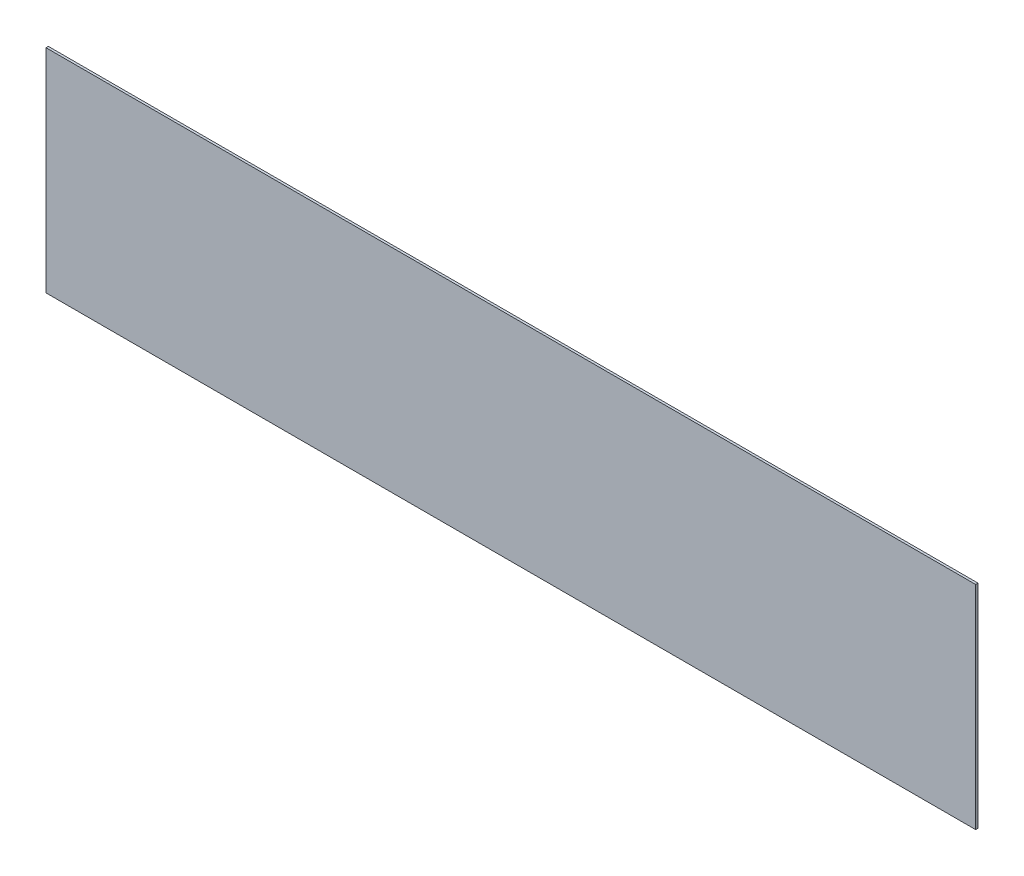
ISO-10303-21;
HEADER;
FILE_DESCRIPTION(('STEP AP214'),'2;1');
FILE_NAME('part.step','',(''),(''),'','','');
FILE_SCHEMA(('AUTOMOTIVE_DESIGN { 1 0 10303 214 1 1 1 1 }'));
ENDSEC;
DATA;
#1=APPLICATION_CONTEXT('core data for automotive mechanical design processes');
#2=APPLICATION_PROTOCOL_DEFINITION('international standard','automotive_design',2000,#1);
#3=PRODUCT_CONTEXT('',#1,'mechanical');
#4=PRODUCT('Part','Part','',(#3));
#5=PRODUCT_RELATED_PRODUCT_CATEGORY('part','',(#4));
#6=PRODUCT_DEFINITION_FORMATION('','',#4);
#7=PRODUCT_DEFINITION_CONTEXT('part definition',#1,'design');
#8=PRODUCT_DEFINITION('design','',#6,#7);
#9=PRODUCT_DEFINITION_SHAPE('','',#8);
#10=(LENGTH_UNIT() NAMED_UNIT(*) SI_UNIT(.MILLI.,.METRE.));
#11=(NAMED_UNIT(*) PLANE_ANGLE_UNIT() SI_UNIT($,.RADIAN.));
#12=(NAMED_UNIT(*) SI_UNIT($,.STERADIAN.) SOLID_ANGLE_UNIT());
#13=UNCERTAINTY_MEASURE_WITH_UNIT(LENGTH_MEASURE(1.E-05),#10,'distance_accuracy_value','');
#14=(GEOMETRIC_REPRESENTATION_CONTEXT(3) GLOBAL_UNCERTAINTY_ASSIGNED_CONTEXT((#13)) GLOBAL_UNIT_ASSIGNED_CONTEXT((#10,
#11,#12)) REPRESENTATION_CONTEXT('',''));
#15=CARTESIAN_POINT('',(0.,0.,0.));
#16=DIRECTION('',(0.,0.,1.));
#17=DIRECTION('',(1.,0.,0.));
#18=AXIS2_PLACEMENT_3D('',#15,#16,#17);
#19=CARTESIAN_POINT('',(-592.709,135.382,0.));
#20=DIRECTION('',(0.,0.,1.));
#21=DIRECTION('',(1.,0.,0.));
#22=AXIS2_PLACEMENT_3D('',#19,#20,#21);
#23=PLANE('',#22);
#24=DIRECTION('',(1.,0.,0.));
#25=VECTOR('',#24,1.);
#26=CARTESIAN_POINT('',(592.709,135.382,0.));
#27=LINE('',#26,#25);
#28=CARTESIAN_POINT('',(-592.709,135.382,0.));
#29=VERTEX_POINT('',#28);
#30=CARTESIAN_POINT('',(592.709,135.382,0.));
#31=VERTEX_POINT('',#30);
#32=EDGE_CURVE('E81',#29,#31,#27,.T.);
#33=ORIENTED_EDGE('',*,*,#32,.T.);
#34=DIRECTION('',(0.,1.,0.));
#35=VECTOR('',#34,1.);
#36=CARTESIAN_POINT('',(592.709,-135.382,0.));
#37=LINE('',#36,#35);
#38=CARTESIAN_POINT('',(592.709,-135.382,0.));
#39=VERTEX_POINT('',#38);
#40=EDGE_CURVE('E68',#31,#39,#37,.F.);
#41=ORIENTED_EDGE('',*,*,#40,.T.);
#42=DIRECTION('',(-1.,0.,0.));
#43=VECTOR('',#42,1.);
#44=CARTESIAN_POINT('',(592.709,-135.382,0.));
#45=LINE('',#44,#43);
#46=CARTESIAN_POINT('',(-592.709,-135.382,0.));
#47=VERTEX_POINT('',#46);
#48=EDGE_CURVE('E55',#39,#47,#45,.T.);
#49=ORIENTED_EDGE('',*,*,#48,.T.);
#50=DIRECTION('',(0.,1.,0.));
#51=VECTOR('',#50,1.);
#52=CARTESIAN_POINT('',(-592.709,-135.382,0.));
#53=LINE('',#52,#51);
#54=EDGE_CURVE('E20',#47,#29,#53,.T.);
#55=ORIENTED_EDGE('',*,*,#54,.T.);
#56=EDGE_LOOP('',(#33,#41,#49,#55));
#57=FACE_BOUND('',#56,.T.);
#58=ADVANCED_FACE('F17',(#57),#23,.F.);
#59=CARTESIAN_POINT('',(-592.709,-135.382,2.9972));
#60=DIRECTION('',(1.,0.,0.));
#61=DIRECTION('',(0.,0.,-1.));
#62=AXIS2_PLACEMENT_3D('',#59,#60,#61);
#63=PLANE('',#62);
#64=DIRECTION('',(0.,0.,1.));
#65=VECTOR('',#64,1.);
#66=CARTESIAN_POINT('',(-592.709,-135.382,2.9972));
#67=LINE('',#66,#65);
#68=CARTESIAN_POINT('',(-592.709,-135.382,2.9972));
#69=VERTEX_POINT('',#68);
#70=EDGE_CURVE('E61',#47,#69,#67,.T.);
#71=ORIENTED_EDGE('',*,*,#70,.T.);
#72=DIRECTION('',(0.,1.,0.));
#73=VECTOR('',#72,1.);
#74=CARTESIAN_POINT('',(-592.709,135.382,2.9972));
#75=LINE('',#74,#73);
#76=CARTESIAN_POINT('',(-592.709,135.382,2.9972));
#77=VERTEX_POINT('',#76);
#78=EDGE_CURVE('E83',#77,#69,#75,.F.);
#79=ORIENTED_EDGE('',*,*,#78,.F.);
#80=DIRECTION('',(0.,0.,1.));
#81=VECTOR('',#80,1.);
#82=CARTESIAN_POINT('',(-592.709,135.382,2.9972));
#83=LINE('',#82,#81);
#84=EDGE_CURVE('E64',#77,#29,#83,.F.);
#85=ORIENTED_EDGE('',*,*,#84,.T.);
#86=ORIENTED_EDGE('',*,*,#54,.F.);
#87=EDGE_LOOP('',(#71,#79,#85,#86));
#88=FACE_BOUND('',#87,.T.);
#89=ADVANCED_FACE('F60',(#88),#63,.F.);
#90=CARTESIAN_POINT('',(592.709,-135.382,2.9972));
#91=DIRECTION('',(0.,1.,0.));
#92=DIRECTION('',(-1.,0.,0.));
#93=AXIS2_PLACEMENT_3D('',#90,#91,#92);
#94=PLANE('',#93);
#95=DIRECTION('',(0.,0.,1.));
#96=VECTOR('',#95,1.);
#97=CARTESIAN_POINT('',(592.709,-135.382,2.9972));
#98=LINE('',#97,#96);
#99=CARTESIAN_POINT('',(592.709,-135.382,2.9972));
#100=VERTEX_POINT('',#99);
#101=EDGE_CURVE('E70',#39,#100,#98,.T.);
#102=ORIENTED_EDGE('',*,*,#101,.T.);
#103=DIRECTION('',(1.,0.,0.));
#104=VECTOR('',#103,1.);
#105=CARTESIAN_POINT('',(-592.709,-135.382,2.9972));
#106=LINE('',#105,#104);
#107=EDGE_CURVE('E74',#69,#100,#106,.T.);
#108=ORIENTED_EDGE('',*,*,#107,.F.);
#109=ORIENTED_EDGE('',*,*,#70,.F.);
#110=ORIENTED_EDGE('',*,*,#48,.F.);
#111=EDGE_LOOP('',(#102,#108,#109,#110));
#112=FACE_BOUND('',#111,.T.);
#113=ADVANCED_FACE('F72',(#112),#94,.F.);
#114=CARTESIAN_POINT('',(592.709,-135.382,2.9972));
#115=DIRECTION('',(-1.,0.,0.));
#116=DIRECTION('',(0.,0.,1.));
#117=AXIS2_PLACEMENT_3D('',#114,#115,#116);
#118=PLANE('',#117);
#119=DIRECTION('',(0.,0.,1.));
#120=VECTOR('',#119,1.);
#121=CARTESIAN_POINT('',(592.709,135.382,2.9972));
#122=LINE('',#121,#120);
#123=CARTESIAN_POINT('',(592.709,135.382,2.9972));
#124=VERTEX_POINT('',#123);
#125=EDGE_CURVE('E35',#31,#124,#122,.T.);
#126=ORIENTED_EDGE('',*,*,#125,.T.);
#127=DIRECTION('',(0.,1.,0.));
#128=VECTOR('',#127,1.);
#129=CARTESIAN_POINT('',(592.709,135.382,2.9972));
#130=LINE('',#129,#128);
#131=EDGE_CURVE('E26',#100,#124,#130,.T.);
#132=ORIENTED_EDGE('',*,*,#131,.F.);
#133=ORIENTED_EDGE('',*,*,#101,.F.);
#134=ORIENTED_EDGE('',*,*,#40,.F.);
#135=EDGE_LOOP('',(#126,#132,#133,#134));
#136=FACE_BOUND('',#135,.T.);
#137=ADVANCED_FACE('F89',(#136),#118,.F.);
#138=CARTESIAN_POINT('',(592.709,135.382,2.9972));
#139=DIRECTION('',(0.,-1.,0.));
#140=DIRECTION('',(1.,0.,0.));
#141=AXIS2_PLACEMENT_3D('',#138,#139,#140);
#142=PLANE('',#141);
#143=ORIENTED_EDGE('',*,*,#84,.F.);
#144=DIRECTION('',(1.,0.,0.));
#145=VECTOR('',#144,1.);
#146=CARTESIAN_POINT('',(-592.709,135.382,2.9972));
#147=LINE('',#146,#145);
#148=EDGE_CURVE('E11',#124,#77,#147,.F.);
#149=ORIENTED_EDGE('',*,*,#148,.F.);
#150=ORIENTED_EDGE('',*,*,#125,.F.);
#151=ORIENTED_EDGE('',*,*,#32,.F.);
#152=EDGE_LOOP('',(#143,#149,#150,#151));
#153=FACE_BOUND('',#152,.T.);
#154=ADVANCED_FACE('F91',(#153),#142,.F.);
#155=CARTESIAN_POINT('',(-592.709,135.382,2.9972));
#156=DIRECTION('',(0.,0.,1.));
#157=DIRECTION('',(1.,0.,0.));
#158=AXIS2_PLACEMENT_3D('',#155,#156,#157);
#159=PLANE('',#158);
#160=ORIENTED_EDGE('',*,*,#131,.T.);
#161=ORIENTED_EDGE('',*,*,#148,.T.);
#162=ORIENTED_EDGE('',*,*,#78,.T.);
#163=ORIENTED_EDGE('',*,*,#107,.T.);
#164=EDGE_LOOP('',(#160,#161,#162,#163));
#165=FACE_BOUND('',#164,.T.);
#166=ADVANCED_FACE('F88',(#165),#159,.T.);
#167=CLOSED_SHELL('',(#58,#89,#113,#137,#154,#166));
#168=MANIFOLD_SOLID_BREP('B1',#167);
#169=ADVANCED_BREP_SHAPE_REPRESENTATION('',(#18,#168),#14);
#170=SHAPE_DEFINITION_REPRESENTATION(#9,#169);
ENDSEC;
END-ISO-10303-21;
